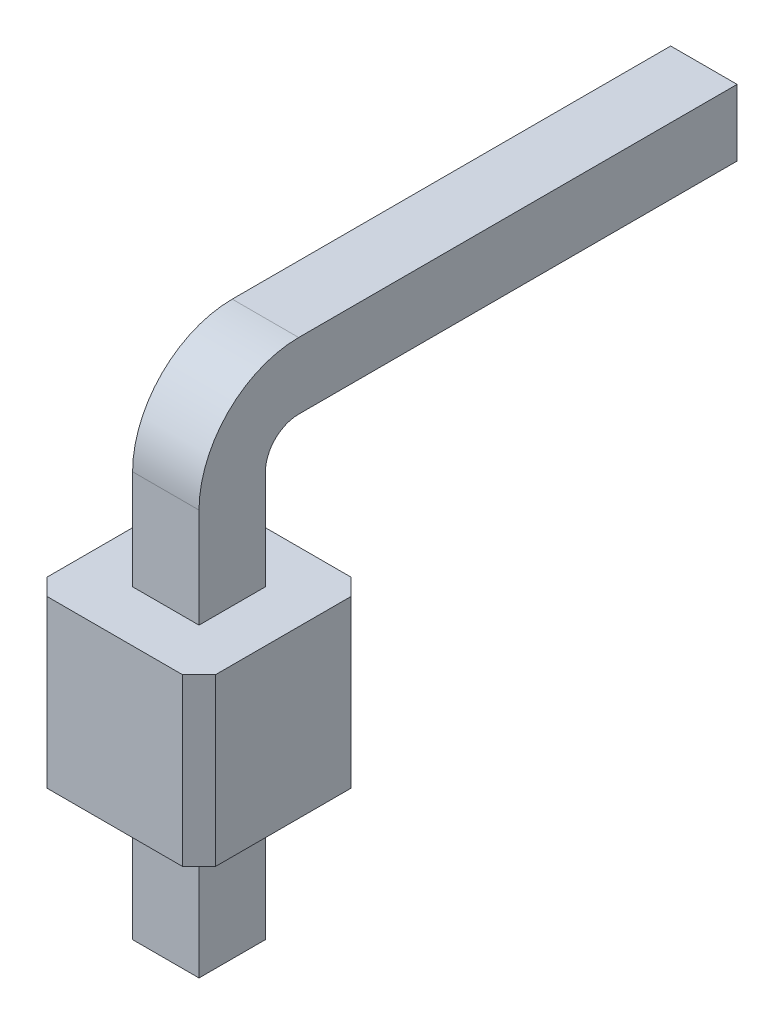
ISO-10303-21;
HEADER;
FILE_DESCRIPTION(('STEP AP214'),'2;1');
FILE_NAME('part.step','',(''),(''),'','','');
FILE_SCHEMA(('AUTOMOTIVE_DESIGN { 1 0 10303 214 1 1 1 1 }'));
ENDSEC;
DATA;
#1=APPLICATION_CONTEXT('core data for automotive mechanical design processes');
#2=APPLICATION_PROTOCOL_DEFINITION('international standard','automotive_design',2000,#1);
#3=PRODUCT_CONTEXT('',#1,'mechanical');
#4=PRODUCT('Part','Part','',(#3));
#5=PRODUCT_RELATED_PRODUCT_CATEGORY('part','',(#4));
#6=PRODUCT_DEFINITION_FORMATION('','',#4);
#7=PRODUCT_DEFINITION_CONTEXT('part definition',#1,'design');
#8=PRODUCT_DEFINITION('design','',#6,#7);
#9=PRODUCT_DEFINITION_SHAPE('','',#8);
#10=(LENGTH_UNIT() NAMED_UNIT(*) SI_UNIT(.MILLI.,.METRE.));
#11=(NAMED_UNIT(*) PLANE_ANGLE_UNIT() SI_UNIT($,.RADIAN.));
#12=(NAMED_UNIT(*) SI_UNIT($,.STERADIAN.) SOLID_ANGLE_UNIT());
#13=UNCERTAINTY_MEASURE_WITH_UNIT(LENGTH_MEASURE(1.E-05),#10,'distance_accuracy_value','');
#14=(GEOMETRIC_REPRESENTATION_CONTEXT(3) GLOBAL_UNCERTAINTY_ASSIGNED_CONTEXT((#13)) GLOBAL_UNIT_ASSIGNED_CONTEXT((#10,
#11,#12)) REPRESENTATION_CONTEXT('',''));
#15=CARTESIAN_POINT('',(0.,0.,0.));
#16=DIRECTION('',(0.,0.,1.));
#17=DIRECTION('',(1.,0.,0.));
#18=AXIS2_PLACEMENT_3D('',#15,#16,#17);
#19=CARTESIAN_POINT('',(0.,2.5,0.));
#20=DIRECTION('',(0.,-1.,0.));
#21=DIRECTION('',(0.,0.,-1.));
#22=AXIS2_PLACEMENT_3D('',#19,#20,#21);
#23=PLANE('',#22);
#24=DIRECTION('',(0.707106781186548,0.,-0.707106781186548));
#25=VECTOR('',#24,1.);
#26=CARTESIAN_POINT('',(1.02,2.5,1.27));
#27=LINE('',#26,#25);
#28=CARTESIAN_POINT('',(1.02,2.5,1.27));
#29=VERTEX_POINT('',#28);
#30=CARTESIAN_POINT('',(1.27,2.5,1.02));
#31=VERTEX_POINT('',#30);
#32=EDGE_CURVE('E261',#29,#31,#27,.T.);
#33=ORIENTED_EDGE('',*,*,#32,.T.);
#34=DIRECTION('',(0.,0.,-1.));
#35=VECTOR('',#34,1.);
#36=CARTESIAN_POINT('',(1.27,2.5,-1.02));
#37=LINE('',#36,#35);
#38=CARTESIAN_POINT('',(1.27,2.5,-1.02));
#39=VERTEX_POINT('',#38);
#40=EDGE_CURVE('E264',#31,#39,#37,.T.);
#41=ORIENTED_EDGE('',*,*,#40,.T.);
#42=DIRECTION('',(-0.707106781186548,0.,-0.707106781186547));
#43=VECTOR('',#42,1.);
#44=CARTESIAN_POINT('',(1.02,2.5,-1.27));
#45=LINE('',#44,#43);
#46=CARTESIAN_POINT('',(1.02,2.5,-1.27));
#47=VERTEX_POINT('',#46);
#48=EDGE_CURVE('E267',#39,#47,#45,.T.);
#49=ORIENTED_EDGE('',*,*,#48,.T.);
#50=DIRECTION('',(-1.,0.,0.));
#51=VECTOR('',#50,1.);
#52=CARTESIAN_POINT('',(-1.02,2.5,-1.27));
#53=LINE('',#52,#51);
#54=CARTESIAN_POINT('',(-1.02,2.5,-1.27));
#55=VERTEX_POINT('',#54);
#56=EDGE_CURVE('E269',#47,#55,#53,.T.);
#57=ORIENTED_EDGE('',*,*,#56,.T.);
#58=DIRECTION('',(-0.707106781186547,0.,0.707106781186548));
#59=VECTOR('',#58,1.);
#60=CARTESIAN_POINT('',(-1.27,2.5,-1.02));
#61=LINE('',#60,#59);
#62=CARTESIAN_POINT('',(-1.27,2.5,-1.02));
#63=VERTEX_POINT('',#62);
#64=EDGE_CURVE('E271',#55,#63,#61,.T.);
#65=ORIENTED_EDGE('',*,*,#64,.T.);
#66=DIRECTION('',(0.,0.,1.));
#67=VECTOR('',#66,1.);
#68=CARTESIAN_POINT('',(-1.27,2.5,1.02));
#69=LINE('',#68,#67);
#70=CARTESIAN_POINT('',(-1.27,2.5,1.02));
#71=VERTEX_POINT('',#70);
#72=EDGE_CURVE('E273',#63,#71,#69,.T.);
#73=ORIENTED_EDGE('',*,*,#72,.T.);
#74=DIRECTION('',(0.707106781186547,0.,0.707106781186548));
#75=VECTOR('',#74,1.);
#76=CARTESIAN_POINT('',(-1.02,2.5,1.27));
#77=LINE('',#76,#75);
#78=CARTESIAN_POINT('',(-1.02,2.5,1.27));
#79=VERTEX_POINT('',#78);
#80=EDGE_CURVE('E275',#71,#79,#77,.T.);
#81=ORIENTED_EDGE('',*,*,#80,.T.);
#82=DIRECTION('',(1.,0.,0.));
#83=VECTOR('',#82,1.);
#84=CARTESIAN_POINT('',(1.02,2.5,1.27));
#85=LINE('',#84,#83);
#86=EDGE_CURVE('E277',#79,#29,#85,.T.);
#87=ORIENTED_EDGE('',*,*,#86,.T.);
#88=EDGE_LOOP('',(#33,#41,#49,#57,#65,#73,#81,#87));
#89=FACE_BOUND('',#88,.T.);
#90=DIRECTION('',(0.,0.,1.));
#91=VECTOR('',#90,1.);
#92=CARTESIAN_POINT('',(-0.5,2.5,0.));
#93=LINE('',#92,#91);
#94=CARTESIAN_POINT('',(-0.5,2.5,-0.5));
#95=VERTEX_POINT('',#94);
#96=CARTESIAN_POINT('',(-0.5,2.5,0.5));
#97=VERTEX_POINT('',#96);
#98=EDGE_CURVE('E252',#95,#97,#93,.T.);
#99=ORIENTED_EDGE('',*,*,#98,.F.);
#100=DIRECTION('',(1.,0.,0.));
#101=VECTOR('',#100,1.);
#102=CARTESIAN_POINT('',(0.,2.5,-0.5));
#103=LINE('',#102,#101);
#104=CARTESIAN_POINT('',(0.5,2.5,-0.5));
#105=VERTEX_POINT('',#104);
#106=EDGE_CURVE('E257',#95,#105,#103,.T.);
#107=ORIENTED_EDGE('',*,*,#106,.T.);
#108=DIRECTION('',(0.,0.,1.));
#109=VECTOR('',#108,1.);
#110=CARTESIAN_POINT('',(0.5,2.5,0.));
#111=LINE('',#110,#109);
#112=CARTESIAN_POINT('',(0.5,2.5,0.5));
#113=VERTEX_POINT('',#112);
#114=EDGE_CURVE('E245',#105,#113,#111,.T.);
#115=ORIENTED_EDGE('',*,*,#114,.T.);
#116=DIRECTION('',(1.,0.,0.));
#117=VECTOR('',#116,1.);
#118=CARTESIAN_POINT('',(0.,2.5,0.5));
#119=LINE('',#118,#117);
#120=EDGE_CURVE('E254',#97,#113,#119,.T.);
#121=ORIENTED_EDGE('',*,*,#120,.F.);
#122=EDGE_LOOP('',(#99,#107,#115,#121));
#123=FACE_BOUND('',#122,.T.);
#124=ADVANCED_FACE('F34',(#89,#123),#23,.F.);
#125=CARTESIAN_POINT('',(0.,0.,0.));
#126=DIRECTION('',(0.,-1.,0.));
#127=DIRECTION('',(0.,0.,-1.));
#128=AXIS2_PLACEMENT_3D('',#125,#126,#127);
#129=PLANE('',#128);
#130=DIRECTION('',(0.707106781186548,0.,-0.707106781186548));
#131=VECTOR('',#130,1.);
#132=CARTESIAN_POINT('',(1.02,0.,1.27));
#133=LINE('',#132,#131);
#134=CARTESIAN_POINT('',(1.02,0.,1.27));
#135=VERTEX_POINT('',#134);
#136=CARTESIAN_POINT('',(1.27,0.,1.02));
#137=VERTEX_POINT('',#136);
#138=EDGE_CURVE('E260',#135,#137,#133,.T.);
#139=ORIENTED_EDGE('',*,*,#138,.F.);
#140=DIRECTION('',(1.,0.,0.));
#141=VECTOR('',#140,1.);
#142=CARTESIAN_POINT('',(1.02,0.,1.27));
#143=LINE('',#142,#141);
#144=CARTESIAN_POINT('',(-1.02,0.,1.27));
#145=VERTEX_POINT('',#144);
#146=EDGE_CURVE('E265',#145,#135,#143,.T.);
#147=ORIENTED_EDGE('',*,*,#146,.F.);
#148=DIRECTION('',(0.707106781186547,0.,0.707106781186548));
#149=VECTOR('',#148,1.);
#150=CARTESIAN_POINT('',(-1.02,0.,1.27));
#151=LINE('',#150,#149);
#152=CARTESIAN_POINT('',(-1.27,0.,1.02));
#153=VERTEX_POINT('',#152);
#154=EDGE_CURVE('E292',#153,#145,#151,.T.);
#155=ORIENTED_EDGE('',*,*,#154,.F.);
#156=DIRECTION('',(0.,0.,1.));
#157=VECTOR('',#156,1.);
#158=CARTESIAN_POINT('',(-1.27,0.,1.02));
#159=LINE('',#158,#157);
#160=CARTESIAN_POINT('',(-1.27,0.,-1.02));
#161=VERTEX_POINT('',#160);
#162=EDGE_CURVE('E290',#161,#153,#159,.T.);
#163=ORIENTED_EDGE('',*,*,#162,.F.);
#164=DIRECTION('',(-0.707106781186547,0.,0.707106781186548));
#165=VECTOR('',#164,1.);
#166=CARTESIAN_POINT('',(-1.27,0.,-1.02));
#167=LINE('',#166,#165);
#168=CARTESIAN_POINT('',(-1.02,0.,-1.27));
#169=VERTEX_POINT('',#168);
#170=EDGE_CURVE('E288',#169,#161,#167,.T.);
#171=ORIENTED_EDGE('',*,*,#170,.F.);
#172=DIRECTION('',(-1.,0.,0.));
#173=VECTOR('',#172,1.);
#174=CARTESIAN_POINT('',(-1.02,0.,-1.27));
#175=LINE('',#174,#173);
#176=CARTESIAN_POINT('',(1.02,0.,-1.27));
#177=VERTEX_POINT('',#176);
#178=EDGE_CURVE('E286',#177,#169,#175,.T.);
#179=ORIENTED_EDGE('',*,*,#178,.F.);
#180=DIRECTION('',(-0.707106781186548,0.,-0.707106781186547));
#181=VECTOR('',#180,1.);
#182=CARTESIAN_POINT('',(1.02,0.,-1.27));
#183=LINE('',#182,#181);
#184=CARTESIAN_POINT('',(1.27,0.,-1.02));
#185=VERTEX_POINT('',#184);
#186=EDGE_CURVE('E284',#185,#177,#183,.T.);
#187=ORIENTED_EDGE('',*,*,#186,.F.);
#188=DIRECTION('',(0.,0.,-1.));
#189=VECTOR('',#188,1.);
#190=CARTESIAN_POINT('',(1.27,0.,-1.02));
#191=LINE('',#190,#189);
#192=EDGE_CURVE('E282',#137,#185,#191,.T.);
#193=ORIENTED_EDGE('',*,*,#192,.F.);
#194=EDGE_LOOP('',(#139,#147,#155,#163,#171,#179,#187,#193));
#195=FACE_BOUND('',#194,.T.);
#196=DIRECTION('',(1.,0.,0.));
#197=VECTOR('',#196,1.);
#198=CARTESIAN_POINT('',(0.,0.,-0.5));
#199=LINE('',#198,#197);
#200=CARTESIAN_POINT('',(-0.5,0.,-0.5));
#201=VERTEX_POINT('',#200);
#202=CARTESIAN_POINT('',(0.5,0.,-0.5));
#203=VERTEX_POINT('',#202);
#204=EDGE_CURVE('E324',#201,#203,#199,.T.);
#205=ORIENTED_EDGE('',*,*,#204,.F.);
#206=DIRECTION('',(0.,0.,1.));
#207=VECTOR('',#206,1.);
#208=CARTESIAN_POINT('',(-0.5,0.,0.));
#209=LINE('',#208,#207);
#210=CARTESIAN_POINT('',(-0.5,0.,0.5));
#211=VERTEX_POINT('',#210);
#212=EDGE_CURVE('E327',#201,#211,#209,.T.);
#213=ORIENTED_EDGE('',*,*,#212,.T.);
#214=DIRECTION('',(1.,0.,0.));
#215=VECTOR('',#214,1.);
#216=CARTESIAN_POINT('',(0.,0.,0.5));
#217=LINE('',#216,#215);
#218=CARTESIAN_POINT('',(0.5,0.,0.5));
#219=VERTEX_POINT('',#218);
#220=EDGE_CURVE('E321',#211,#219,#217,.T.);
#221=ORIENTED_EDGE('',*,*,#220,.T.);
#222=DIRECTION('',(0.,0.,1.));
#223=VECTOR('',#222,1.);
#224=CARTESIAN_POINT('',(0.5,0.,0.));
#225=LINE('',#224,#223);
#226=EDGE_CURVE('E318',#203,#219,#225,.T.);
#227=ORIENTED_EDGE('',*,*,#226,.F.);
#228=EDGE_LOOP('',(#205,#213,#221,#227));
#229=FACE_BOUND('',#228,.T.);
#230=ADVANCED_FACE('F431',(#195,#229),#129,.T.);
#231=CARTESIAN_POINT('',(1.02,2.5,1.27));
#232=DIRECTION('',(-0.707106781186548,0.,-0.707106781186548));
#233=DIRECTION('',(-0.707106781186548,0.,0.707106781186548));
#234=AXIS2_PLACEMENT_3D('',#231,#232,#233);
#235=PLANE('',#234);
#236=ORIENTED_EDGE('',*,*,#138,.T.);
#237=DIRECTION('',(0.,-1.,0.));
#238=VECTOR('',#237,1.);
#239=CARTESIAN_POINT('',(1.27,2.5,1.02));
#240=LINE('',#239,#238);
#241=EDGE_CURVE('E315',#31,#137,#240,.T.);
#242=ORIENTED_EDGE('',*,*,#241,.F.);
#243=ORIENTED_EDGE('',*,*,#32,.F.);
#244=DIRECTION('',(0.,-1.,0.));
#245=VECTOR('',#244,1.);
#246=CARTESIAN_POINT('',(1.02,2.5,1.27));
#247=LINE('',#246,#245);
#248=EDGE_CURVE('E279',#29,#135,#247,.T.);
#249=ORIENTED_EDGE('',*,*,#248,.T.);
#250=EDGE_LOOP('',(#236,#242,#243,#249));
#251=FACE_BOUND('',#250,.T.);
#252=ADVANCED_FACE('F437',(#251),#235,.F.);
#253=CARTESIAN_POINT('',(1.27,2.5,-1.02));
#254=DIRECTION('',(-1.,0.,0.));
#255=DIRECTION('',(0.,0.,1.));
#256=AXIS2_PLACEMENT_3D('',#253,#254,#255);
#257=PLANE('',#256);
#258=ORIENTED_EDGE('',*,*,#192,.T.);
#259=DIRECTION('',(0.,-1.,0.));
#260=VECTOR('',#259,1.);
#261=CARTESIAN_POINT('',(1.27,2.5,-1.02));
#262=LINE('',#261,#260);
#263=EDGE_CURVE('E312',#39,#185,#262,.T.);
#264=ORIENTED_EDGE('',*,*,#263,.F.);
#265=ORIENTED_EDGE('',*,*,#40,.F.);
#266=ORIENTED_EDGE('',*,*,#241,.T.);
#267=EDGE_LOOP('',(#258,#264,#265,#266));
#268=FACE_BOUND('',#267,.T.);
#269=ADVANCED_FACE('F467',(#268),#257,.F.);
#270=CARTESIAN_POINT('',(1.02,2.5,-1.27));
#271=DIRECTION('',(-0.707106781186547,0.,0.707106781186548));
#272=DIRECTION('',(0.707106781186548,0.,0.707106781186547));
#273=AXIS2_PLACEMENT_3D('',#270,#271,#272);
#274=PLANE('',#273);
#275=ORIENTED_EDGE('',*,*,#186,.T.);
#276=DIRECTION('',(0.,-1.,0.));
#277=VECTOR('',#276,1.);
#278=CARTESIAN_POINT('',(1.02,2.5,-1.27));
#279=LINE('',#278,#277);
#280=EDGE_CURVE('E309',#47,#177,#279,.T.);
#281=ORIENTED_EDGE('',*,*,#280,.F.);
#282=ORIENTED_EDGE('',*,*,#48,.F.);
#283=ORIENTED_EDGE('',*,*,#263,.T.);
#284=EDGE_LOOP('',(#275,#281,#282,#283));
#285=FACE_BOUND('',#284,.T.);
#286=ADVANCED_FACE('F463',(#285),#274,.F.);
#287=CARTESIAN_POINT('',(-1.02,2.5,-1.27));
#288=DIRECTION('',(0.,0.,1.));
#289=DIRECTION('',(1.,0.,0.));
#290=AXIS2_PLACEMENT_3D('',#287,#288,#289);
#291=PLANE('',#290);
#292=ORIENTED_EDGE('',*,*,#178,.T.);
#293=DIRECTION('',(0.,-1.,0.));
#294=VECTOR('',#293,1.);
#295=CARTESIAN_POINT('',(-1.02,2.5,-1.27));
#296=LINE('',#295,#294);
#297=EDGE_CURVE('E306',#55,#169,#296,.T.);
#298=ORIENTED_EDGE('',*,*,#297,.F.);
#299=ORIENTED_EDGE('',*,*,#56,.F.);
#300=ORIENTED_EDGE('',*,*,#280,.T.);
#301=EDGE_LOOP('',(#292,#298,#299,#300));
#302=FACE_BOUND('',#301,.T.);
#303=ADVANCED_FACE('F459',(#302),#291,.F.);
#304=CARTESIAN_POINT('',(-1.27,2.5,-1.02));
#305=DIRECTION('',(0.707106781186548,0.,0.707106781186547));
#306=DIRECTION('',(0.707106781186547,0.,-0.707106781186548));
#307=AXIS2_PLACEMENT_3D('',#304,#305,#306);
#308=PLANE('',#307);
#309=ORIENTED_EDGE('',*,*,#170,.T.);
#310=DIRECTION('',(0.,-1.,0.));
#311=VECTOR('',#310,1.);
#312=CARTESIAN_POINT('',(-1.27,2.5,-1.02));
#313=LINE('',#312,#311);
#314=EDGE_CURVE('E303',#63,#161,#313,.T.);
#315=ORIENTED_EDGE('',*,*,#314,.F.);
#316=ORIENTED_EDGE('',*,*,#64,.F.);
#317=ORIENTED_EDGE('',*,*,#297,.T.);
#318=EDGE_LOOP('',(#309,#315,#316,#317));
#319=FACE_BOUND('',#318,.T.);
#320=ADVANCED_FACE('F455',(#319),#308,.F.);
#321=CARTESIAN_POINT('',(-1.27,2.5,1.02));
#322=DIRECTION('',(1.,0.,0.));
#323=DIRECTION('',(0.,0.,-1.));
#324=AXIS2_PLACEMENT_3D('',#321,#322,#323);
#325=PLANE('',#324);
#326=ORIENTED_EDGE('',*,*,#162,.T.);
#327=DIRECTION('',(0.,-1.,0.));
#328=VECTOR('',#327,1.);
#329=CARTESIAN_POINT('',(-1.27,2.5,1.02));
#330=LINE('',#329,#328);
#331=EDGE_CURVE('E300',#71,#153,#330,.T.);
#332=ORIENTED_EDGE('',*,*,#331,.F.);
#333=ORIENTED_EDGE('',*,*,#72,.F.);
#334=ORIENTED_EDGE('',*,*,#314,.T.);
#335=EDGE_LOOP('',(#326,#332,#333,#334));
#336=FACE_BOUND('',#335,.T.);
#337=ADVANCED_FACE('F451',(#336),#325,.F.);
#338=CARTESIAN_POINT('',(-1.02,2.5,1.27));
#339=DIRECTION('',(0.707106781186548,0.,-0.707106781186547));
#340=DIRECTION('',(-0.707106781186547,0.,-0.707106781186548));
#341=AXIS2_PLACEMENT_3D('',#338,#339,#340);
#342=PLANE('',#341);
#343=ORIENTED_EDGE('',*,*,#154,.T.);
#344=DIRECTION('',(0.,-1.,0.));
#345=VECTOR('',#344,1.);
#346=CARTESIAN_POINT('',(-1.02,2.5,1.27));
#347=LINE('',#346,#345);
#348=EDGE_CURVE('E297',#79,#145,#347,.T.);
#349=ORIENTED_EDGE('',*,*,#348,.F.);
#350=ORIENTED_EDGE('',*,*,#80,.F.);
#351=ORIENTED_EDGE('',*,*,#331,.T.);
#352=EDGE_LOOP('',(#343,#349,#350,#351));
#353=FACE_BOUND('',#352,.T.);
#354=ADVANCED_FACE('F447',(#353),#342,.F.);
#355=CARTESIAN_POINT('',(1.02,2.5,1.27));
#356=DIRECTION('',(0.,0.,-1.));
#357=DIRECTION('',(-1.,0.,0.));
#358=AXIS2_PLACEMENT_3D('',#355,#356,#357);
#359=PLANE('',#358);
#360=ORIENTED_EDGE('',*,*,#146,.T.);
#361=ORIENTED_EDGE('',*,*,#248,.F.);
#362=ORIENTED_EDGE('',*,*,#86,.F.);
#363=ORIENTED_EDGE('',*,*,#348,.T.);
#364=EDGE_LOOP('',(#360,#361,#362,#363));
#365=FACE_BOUND('',#364,.T.);
#366=ADVANCED_FACE('F443',(#365),#359,.F.);
#367=CARTESIAN_POINT('',(-0.5,-2.5,-0.5));
#368=DIRECTION('',(0.,1.,0.));
#369=DIRECTION('',(0.,0.,1.));
#370=AXIS2_PLACEMENT_3D('',#367,#368,#369);
#371=PLANE('',#370);
#372=DIRECTION('',(0.,0.,-1.));
#373=VECTOR('',#372,1.);
#374=CARTESIAN_POINT('',(-0.0999999999999972,-2.5,-0.5));
#375=LINE('',#374,#373);
#376=CARTESIAN_POINT('',(-0.0999999999999972,-2.5,0.099999999999997));
#377=VERTEX_POINT('',#376);
#378=CARTESIAN_POINT('',(-0.0999999999999972,-2.5,-0.0999999999999972));
#379=VERTEX_POINT('',#378);
#380=EDGE_CURVE('E334',#377,#379,#375,.T.);
#381=ORIENTED_EDGE('',*,*,#380,.T.);
#382=DIRECTION('',(1.,0.,0.));
#383=VECTOR('',#382,1.);
#384=CARTESIAN_POINT('',(0.5,-2.5,-0.0999999999999972));
#385=LINE('',#384,#383);
#386=CARTESIAN_POINT('',(0.0999999999999972,-2.5,-0.0999999999999972));
#387=VERTEX_POINT('',#386);
#388=EDGE_CURVE('E336',#379,#387,#385,.T.);
#389=ORIENTED_EDGE('',*,*,#388,.T.);
#390=DIRECTION('',(0.,0.,1.));
#391=VECTOR('',#390,1.);
#392=CARTESIAN_POINT('',(0.0999999999999972,-2.5,0.5));
#393=LINE('',#392,#391);
#394=CARTESIAN_POINT('',(0.0999999999999972,-2.5,0.099999999999997));
#395=VERTEX_POINT('',#394);
#396=EDGE_CURVE('E330',#387,#395,#393,.T.);
#397=ORIENTED_EDGE('',*,*,#396,.T.);
#398=DIRECTION('',(-1.,0.,0.));
#399=VECTOR('',#398,1.);
#400=CARTESIAN_POINT('',(-0.5,-2.5,0.099999999999997));
#401=LINE('',#400,#399);
#402=EDGE_CURVE('E332',#395,#377,#401,.T.);
#403=ORIENTED_EDGE('',*,*,#402,.T.);
#404=EDGE_LOOP('',(#381,#389,#397,#403));
#405=FACE_BOUND('',#404,.T.);
#406=ADVANCED_FACE('F446',(#405),#371,.F.);
#407=CARTESIAN_POINT('',(0.5,4.,-1.));
#408=DIRECTION('',(1.,0.,0.));
#409=DIRECTION('',(0.,0.,-1.));
#410=AXIS2_PLACEMENT_3D('',#407,#408,#409);
#411=PLANE('',#410);
#412=DIRECTION('',(0.,1.,0.));
#413=VECTOR('',#412,1.);
#414=CARTESIAN_POINT('',(0.5,0.,0.5));
#415=LINE('',#414,#413);
#416=CARTESIAN_POINT('',(0.5,-2.1,0.5));
#417=VERTEX_POINT('',#416);
#418=EDGE_CURVE('E220',#417,#219,#415,.T.);
#419=ORIENTED_EDGE('',*,*,#418,.F.);
#420=DIRECTION('',(0.,0.,-1.));
#421=VECTOR('',#420,1.);
#422=CARTESIAN_POINT('',(0.5,-2.1,-0.5));
#423=LINE('',#422,#421);
#424=CARTESIAN_POINT('',(0.5,-2.1,-0.5));
#425=VERTEX_POINT('',#424);
#426=EDGE_CURVE('E346',#417,#425,#423,.T.);
#427=ORIENTED_EDGE('',*,*,#426,.T.);
#428=DIRECTION('',(0.,1.,0.));
#429=VECTOR('',#428,1.);
#430=CARTESIAN_POINT('',(0.5,0.,-0.5));
#431=LINE('',#430,#429);
#432=EDGE_CURVE('E225',#425,#203,#431,.T.);
#433=ORIENTED_EDGE('',*,*,#432,.T.);
#434=ORIENTED_EDGE('',*,*,#226,.T.);
#435=EDGE_LOOP('',(#419,#427,#433,#434));
#436=FACE_BOUND('',#435,.T.);
#437=ADVANCED_FACE('F550',(#436),#411,.T.);
#438=CARTESIAN_POINT('',(-0.5,4.,-1.));
#439=DIRECTION('',(1.,0.,0.));
#440=DIRECTION('',(0.,0.,-1.));
#441=AXIS2_PLACEMENT_3D('',#438,#439,#440);
#442=PLANE('',#441);
#443=DIRECTION('',(0.,1.,0.));
#444=VECTOR('',#443,1.);
#445=CARTESIAN_POINT('',(-0.5,0.,-0.5));
#446=LINE('',#445,#444);
#447=CARTESIAN_POINT('',(-0.5,-2.1,-0.5));
#448=VERTEX_POINT('',#447);
#449=EDGE_CURVE('E239',#448,#201,#446,.T.);
#450=ORIENTED_EDGE('',*,*,#449,.F.);
#451=DIRECTION('',(0.,0.,1.));
#452=VECTOR('',#451,1.);
#453=CARTESIAN_POINT('',(-0.5,-2.1,-1.));
#454=LINE('',#453,#452);
#455=CARTESIAN_POINT('',(-0.5,-2.1,0.5));
#456=VERTEX_POINT('',#455);
#457=EDGE_CURVE('E342',#448,#456,#454,.T.);
#458=ORIENTED_EDGE('',*,*,#457,.T.);
#459=DIRECTION('',(0.,1.,0.));
#460=VECTOR('',#459,1.);
#461=CARTESIAN_POINT('',(-0.5,0.,0.5));
#462=LINE('',#461,#460);
#463=EDGE_CURVE('E236',#456,#211,#462,.T.);
#464=ORIENTED_EDGE('',*,*,#463,.T.);
#465=ORIENTED_EDGE('',*,*,#212,.F.);
#466=EDGE_LOOP('',(#450,#458,#464,#465));
#467=FACE_BOUND('',#466,.T.);
#468=ADVANCED_FACE('F423',(#467),#442,.F.);
#469=CARTESIAN_POINT('',(-0.5,0.,0.5));
#470=DIRECTION('',(0.,0.,-1.));
#471=DIRECTION('',(0.,1.,0.));
#472=AXIS2_PLACEMENT_3D('',#469,#470,#471);
#473=PLANE('',#472);
#474=ORIENTED_EDGE('',*,*,#463,.F.);
#475=DIRECTION('',(1.,0.,0.));
#476=VECTOR('',#475,1.);
#477=CARTESIAN_POINT('',(-0.5,-2.1,0.5));
#478=LINE('',#477,#476);
#479=EDGE_CURVE('E344',#456,#417,#478,.T.);
#480=ORIENTED_EDGE('',*,*,#479,.T.);
#481=ORIENTED_EDGE('',*,*,#418,.T.);
#482=ORIENTED_EDGE('',*,*,#220,.F.);
#483=EDGE_LOOP('',(#474,#480,#481,#482));
#484=FACE_BOUND('',#483,.T.);
#485=ADVANCED_FACE('F417',(#484),#473,.F.);
#486=CARTESIAN_POINT('',(-0.5,0.,-0.5));
#487=DIRECTION('',(0.,0.,-1.));
#488=DIRECTION('',(-1.,0.,0.));
#489=AXIS2_PLACEMENT_3D('',#486,#487,#488);
#490=PLANE('',#489);
#491=ORIENTED_EDGE('',*,*,#432,.F.);
#492=DIRECTION('',(-1.,0.,0.));
#493=VECTOR('',#492,1.);
#494=CARTESIAN_POINT('',(-0.5,-2.1,-0.5));
#495=LINE('',#494,#493);
#496=EDGE_CURVE('E339',#425,#448,#495,.T.);
#497=ORIENTED_EDGE('',*,*,#496,.T.);
#498=ORIENTED_EDGE('',*,*,#449,.T.);
#499=ORIENTED_EDGE('',*,*,#204,.T.);
#500=EDGE_LOOP('',(#491,#497,#498,#499));
#501=FACE_BOUND('',#500,.T.);
#502=ADVANCED_FACE('F424',(#501),#490,.T.);
#503=ORIENTED_EDGE('',*,*,#106,.F.);
#504=CARTESIAN_POINT('',(-0.5,4.,-0.5));
#505=VERTEX_POINT('',#504);
#506=EDGE_CURVE('E238',#95,#505,#446,.T.);
#507=ORIENTED_EDGE('',*,*,#506,.T.);
#508=DIRECTION('',(1.,0.,0.));
#509=VECTOR('',#508,1.);
#510=CARTESIAN_POINT('',(-0.5,4.,-0.5));
#511=LINE('',#510,#509);
#512=CARTESIAN_POINT('',(0.5,4.,-0.5));
#513=VERTEX_POINT('',#512);
#514=EDGE_CURVE('E246',#505,#513,#511,.T.);
#515=ORIENTED_EDGE('',*,*,#514,.T.);
#516=EDGE_CURVE('E224',#105,#513,#431,.T.);
#517=ORIENTED_EDGE('',*,*,#516,.F.);
#518=EDGE_LOOP('',(#503,#507,#515,#517));
#519=FACE_BOUND('',#518,.T.);
#520=ADVANCED_FACE('F407',(#519),#490,.T.);
#521=CARTESIAN_POINT('',(-0.5,4.,0.5));
#522=VERTEX_POINT('',#521);
#523=EDGE_CURVE('E235',#97,#522,#462,.T.);
#524=ORIENTED_EDGE('',*,*,#523,.F.);
#525=ORIENTED_EDGE('',*,*,#120,.T.);
#526=CARTESIAN_POINT('',(0.5,4.,0.5));
#527=VERTEX_POINT('',#526);
#528=EDGE_CURVE('E218',#113,#527,#415,.T.);
#529=ORIENTED_EDGE('',*,*,#528,.T.);
#530=DIRECTION('',(1.,0.,0.));
#531=VECTOR('',#530,1.);
#532=CARTESIAN_POINT('',(-0.5,4.,0.5));
#533=LINE('',#532,#531);
#534=EDGE_CURVE('E207',#522,#527,#533,.T.);
#535=ORIENTED_EDGE('',*,*,#534,.F.);
#536=EDGE_LOOP('',(#524,#525,#529,#535));
#537=FACE_BOUND('',#536,.T.);
#538=ADVANCED_FACE('F414',(#537),#473,.F.);
#539=DIRECTION('',(0.,0.,-1.));
#540=VECTOR('',#539,1.);
#541=CARTESIAN_POINT('',(-0.5,5.5,-1.));
#542=LINE('',#541,#540);
#543=CARTESIAN_POINT('',(-0.5,5.5,-1.));
#544=VERTEX_POINT('',#543);
#545=CARTESIAN_POINT('',(-0.5,5.5,-7.6));
#546=VERTEX_POINT('',#545);
#547=EDGE_CURVE('E203',#544,#546,#542,.T.);
#548=ORIENTED_EDGE('',*,*,#547,.T.);
#549=DIRECTION('',(0.,-1.,0.));
#550=VECTOR('',#549,1.);
#551=CARTESIAN_POINT('',(-0.5,4.,-7.6));
#552=LINE('',#551,#550);
#553=CARTESIAN_POINT('',(-0.5,4.5,-7.6));
#554=VERTEX_POINT('',#553);
#555=EDGE_CURVE('E348',#546,#554,#552,.T.);
#556=ORIENTED_EDGE('',*,*,#555,.T.);
#557=DIRECTION('',(0.,0.,-1.));
#558=VECTOR('',#557,1.);
#559=CARTESIAN_POINT('',(-0.5,4.5,-1.));
#560=LINE('',#559,#558);
#561=CARTESIAN_POINT('',(-0.5,4.5,-1.));
#562=VERTEX_POINT('',#561);
#563=EDGE_CURVE('E230',#562,#554,#560,.T.);
#564=ORIENTED_EDGE('',*,*,#563,.F.);
#565=CARTESIAN_POINT('',(-0.5,4.,-1.));
#566=DIRECTION('',(1.,0.,0.));
#567=DIRECTION('',(0.,0.,-1.));
#568=AXIS2_PLACEMENT_3D('',#565,#566,#567);
#569=CIRCLE('',#568,0.5);
#570=EDGE_CURVE('E208',#505,#562,#569,.F.);
#571=ORIENTED_EDGE('',*,*,#570,.F.);
#572=ORIENTED_EDGE('',*,*,#506,.F.);
#573=ORIENTED_EDGE('',*,*,#98,.T.);
#574=ORIENTED_EDGE('',*,*,#523,.T.);
#575=CARTESIAN_POINT('',(-0.5,4.,-1.));
#576=DIRECTION('',(1.,0.,0.));
#577=DIRECTION('',(0.,0.,-1.));
#578=AXIS2_PLACEMENT_3D('',#575,#576,#577);
#579=CIRCLE('',#578,1.5);
#580=EDGE_CURVE('E233',#522,#544,#579,.F.);
#581=ORIENTED_EDGE('',*,*,#580,.T.);
#582=EDGE_LOOP('',(#548,#556,#564,#571,#572,#573,#574,#581));
#583=FACE_BOUND('',#582,.T.);
#584=ADVANCED_FACE('F398',(#583),#442,.F.);
#585=DIRECTION('',(0.,0.,-1.));
#586=VECTOR('',#585,1.);
#587=CARTESIAN_POINT('',(0.5,4.5,-1.));
#588=LINE('',#587,#586);
#589=CARTESIAN_POINT('',(0.5,4.5,-1.));
#590=VERTEX_POINT('',#589);
#591=CARTESIAN_POINT('',(0.5,4.5,-7.6));
#592=VERTEX_POINT('',#591);
#593=EDGE_CURVE('E213',#590,#592,#588,.T.);
#594=ORIENTED_EDGE('',*,*,#593,.T.);
#595=DIRECTION('',(0.,1.,0.));
#596=VECTOR('',#595,1.);
#597=CARTESIAN_POINT('',(0.5,5.5,-7.6));
#598=LINE('',#597,#596);
#599=CARTESIAN_POINT('',(0.5,5.5,-7.6));
#600=VERTEX_POINT('',#599);
#601=EDGE_CURVE('E43',#592,#600,#598,.T.);
#602=ORIENTED_EDGE('',*,*,#601,.T.);
#603=DIRECTION('',(0.,0.,-1.));
#604=VECTOR('',#603,1.);
#605=CARTESIAN_POINT('',(0.5,5.5,-1.));
#606=LINE('',#605,#604);
#607=CARTESIAN_POINT('',(0.5,5.5,-1.));
#608=VERTEX_POINT('',#607);
#609=EDGE_CURVE('E200',#608,#600,#606,.T.);
#610=ORIENTED_EDGE('',*,*,#609,.F.);
#611=CARTESIAN_POINT('',(0.5,4.,-1.));
#612=DIRECTION('',(1.,0.,0.));
#613=DIRECTION('',(0.,0.,-1.));
#614=AXIS2_PLACEMENT_3D('',#611,#612,#613);
#615=CIRCLE('',#614,1.5);
#616=EDGE_CURVE('E212',#527,#608,#615,.F.);
#617=ORIENTED_EDGE('',*,*,#616,.F.);
#618=ORIENTED_EDGE('',*,*,#528,.F.);
#619=ORIENTED_EDGE('',*,*,#114,.F.);
#620=ORIENTED_EDGE('',*,*,#516,.T.);
#621=CARTESIAN_POINT('',(0.5,4.,-1.));
#622=DIRECTION('',(1.,0.,0.));
#623=DIRECTION('',(0.,0.,-1.));
#624=AXIS2_PLACEMENT_3D('',#621,#622,#623);
#625=CIRCLE('',#624,0.5);
#626=EDGE_CURVE('E227',#513,#590,#625,.F.);
#627=ORIENTED_EDGE('',*,*,#626,.T.);
#628=EDGE_LOOP('',(#594,#602,#610,#617,#618,#619,#620,#627));
#629=FACE_BOUND('',#628,.T.);
#630=ADVANCED_FACE('F211',(#629),#411,.T.);
#631=CARTESIAN_POINT('',(-0.5,4.5,-1.));
#632=DIRECTION('',(0.,-1.,0.));
#633=DIRECTION('',(0.,0.,-1.));
#634=AXIS2_PLACEMENT_3D('',#631,#632,#633);
#635=PLANE('',#634);
#636=ORIENTED_EDGE('',*,*,#563,.T.);
#637=DIRECTION('',(1.,0.,0.));
#638=VECTOR('',#637,1.);
#639=CARTESIAN_POINT('',(0.5,4.5,-7.6));
#640=LINE('',#639,#638);
#641=EDGE_CURVE('E58',#554,#592,#640,.T.);
#642=ORIENTED_EDGE('',*,*,#641,.T.);
#643=ORIENTED_EDGE('',*,*,#593,.F.);
#644=DIRECTION('',(1.,0.,0.));
#645=VECTOR('',#644,1.);
#646=CARTESIAN_POINT('',(-0.5,4.5,-1.));
#647=LINE('',#646,#645);
#648=EDGE_CURVE('E243',#562,#590,#647,.T.);
#649=ORIENTED_EDGE('',*,*,#648,.F.);
#650=EDGE_LOOP('',(#636,#642,#643,#649));
#651=FACE_BOUND('',#650,.T.);
#652=ADVANCED_FACE('F400',(#651),#635,.T.);
#653=CARTESIAN_POINT('',(-0.5,4.,-1.));
#654=DIRECTION('',(1.,0.,0.));
#655=DIRECTION('',(0.,0.,-1.));
#656=AXIS2_PLACEMENT_3D('',#653,#654,#655);
#657=CYLINDRICAL_SURFACE('',#656,0.5);
#658=ORIENTED_EDGE('',*,*,#648,.T.);
#659=ORIENTED_EDGE('',*,*,#626,.F.);
#660=ORIENTED_EDGE('',*,*,#514,.F.);
#661=ORIENTED_EDGE('',*,*,#570,.T.);
#662=EDGE_LOOP('',(#658,#659,#660,#661));
#663=FACE_BOUND('',#662,.T.);
#664=ADVANCED_FACE('F403',(#663),#657,.F.);
#665=CARTESIAN_POINT('',(-0.5,4.,-1.));
#666=DIRECTION('',(1.,0.,0.));
#667=DIRECTION('',(0.,0.,-1.));
#668=AXIS2_PLACEMENT_3D('',#665,#666,#667);
#669=CYLINDRICAL_SURFACE('',#668,1.5);
#670=ORIENTED_EDGE('',*,*,#534,.T.);
#671=ORIENTED_EDGE('',*,*,#616,.T.);
#672=DIRECTION('',(1.,0.,0.));
#673=VECTOR('',#672,1.);
#674=CARTESIAN_POINT('',(-0.5,5.5,-1.));
#675=LINE('',#674,#673);
#676=EDGE_CURVE('E198',#544,#608,#675,.T.);
#677=ORIENTED_EDGE('',*,*,#676,.F.);
#678=ORIENTED_EDGE('',*,*,#580,.F.);
#679=EDGE_LOOP('',(#670,#671,#677,#678));
#680=FACE_BOUND('',#679,.T.);
#681=ADVANCED_FACE('F216',(#680),#669,.T.);
#682=CARTESIAN_POINT('',(-0.5,5.5,-1.));
#683=DIRECTION('',(0.,-1.,0.));
#684=DIRECTION('',(0.,0.,-1.));
#685=AXIS2_PLACEMENT_3D('',#682,#683,#684);
#686=PLANE('',#685);
#687=ORIENTED_EDGE('',*,*,#609,.T.);
#688=DIRECTION('',(-1.,0.,0.));
#689=VECTOR('',#688,1.);
#690=CARTESIAN_POINT('',(-0.5,5.5,-7.6));
#691=LINE('',#690,#689);
#692=EDGE_CURVE('E11',#600,#546,#691,.T.);
#693=ORIENTED_EDGE('',*,*,#692,.T.);
#694=ORIENTED_EDGE('',*,*,#547,.F.);
#695=ORIENTED_EDGE('',*,*,#676,.T.);
#696=EDGE_LOOP('',(#687,#693,#694,#695));
#697=FACE_BOUND('',#696,.T.);
#698=ADVANCED_FACE('F199',(#697),#686,.F.);
#699=CARTESIAN_POINT('',(-0.5,5.5,-8.));
#700=DIRECTION('',(0.,0.,1.));
#701=DIRECTION('',(1.,0.,0.));
#702=AXIS2_PLACEMENT_3D('',#699,#700,#701);
#703=PLANE('',#702);
#704=DIRECTION('',(-1.,0.,0.));
#705=VECTOR('',#704,1.);
#706=CARTESIAN_POINT('',(-0.5,4.9,-8.));
#707=LINE('',#706,#705);
#708=CARTESIAN_POINT('',(0.0999999999999972,4.9,-8.));
#709=VERTEX_POINT('',#708);
#710=CARTESIAN_POINT('',(-0.0999999999999972,4.9,-8.));
#711=VERTEX_POINT('',#710);
#712=EDGE_CURVE('E355',#709,#711,#707,.T.);
#713=ORIENTED_EDGE('',*,*,#712,.T.);
#714=DIRECTION('',(0.,1.,0.));
#715=VECTOR('',#714,1.);
#716=CARTESIAN_POINT('',(-0.0999999999999972,5.5,-8.));
#717=LINE('',#716,#715);
#718=CARTESIAN_POINT('',(-0.0999999999999972,5.1,-8.));
#719=VERTEX_POINT('',#718);
#720=EDGE_CURVE('E357',#711,#719,#717,.T.);
#721=ORIENTED_EDGE('',*,*,#720,.T.);
#722=DIRECTION('',(1.,0.,0.));
#723=VECTOR('',#722,1.);
#724=CARTESIAN_POINT('',(-0.5,5.1,-8.));
#725=LINE('',#724,#723);
#726=CARTESIAN_POINT('',(0.0999999999999972,5.1,-8.));
#727=VERTEX_POINT('',#726);
#728=EDGE_CURVE('E351',#719,#727,#725,.T.);
#729=ORIENTED_EDGE('',*,*,#728,.T.);
#730=DIRECTION('',(0.,-1.,0.));
#731=VECTOR('',#730,1.);
#732=CARTESIAN_POINT('',(0.0999999999999972,4.5,-8.));
#733=LINE('',#732,#731);
#734=EDGE_CURVE('E353',#727,#709,#733,.T.);
#735=ORIENTED_EDGE('',*,*,#734,.T.);
#736=EDGE_LOOP('',(#713,#721,#729,#735));
#737=FACE_BOUND('',#736,.T.);
#738=ADVANCED_FACE('F389',(#737),#703,.F.);
#739=CARTESIAN_POINT('',(-0.5,-2.1,0.5));
#740=DIRECTION('',(0.,0.707106781186551,-0.707106781186544));
#741=DIRECTION('',(1.,0.,0.));
#742=AXIS2_PLACEMENT_3D('',#739,#740,#741);
#743=PLANE('',#742);
#744=DIRECTION('',(0.577350269189628,0.577350269189622,0.577350269189627));
#745=VECTOR('',#744,1.);
#746=CARTESIAN_POINT('',(-0.100000000000003,-2.7,-0.100000000000003));
#747=LINE('',#746,#745);
#748=EDGE_CURVE('E366',#417,#395,#747,.F.);
#749=ORIENTED_EDGE('',*,*,#748,.F.);
#750=ORIENTED_EDGE('',*,*,#479,.F.);
#751=DIRECTION('',(0.577350269189628,-0.577350269189622,-0.577350269189627));
#752=VECTOR('',#751,1.);
#753=CARTESIAN_POINT('',(-0.5,-2.1,0.5));
#754=LINE('',#753,#752);
#755=EDGE_CURVE('E369',#377,#456,#754,.F.);
#756=ORIENTED_EDGE('',*,*,#755,.F.);
#757=ORIENTED_EDGE('',*,*,#402,.F.);
#758=EDGE_LOOP('',(#749,#750,#756,#757));
#759=FACE_BOUND('',#758,.T.);
#760=ADVANCED_FACE('F486',(#759),#743,.F.);
#761=CARTESIAN_POINT('',(-0.5,-2.1,-1.));
#762=DIRECTION('',(0.707106781186544,0.707106781186551,0.));
#763=DIRECTION('',(0.,0.,1.));
#764=AXIS2_PLACEMENT_3D('',#761,#762,#763);
#765=PLANE('',#764);
#766=ORIENTED_EDGE('',*,*,#755,.T.);
#767=ORIENTED_EDGE('',*,*,#457,.F.);
#768=DIRECTION('',(-0.577350269189628,0.577350269189622,-0.577350269189627));
#769=VECTOR('',#768,1.);
#770=CARTESIAN_POINT('',(-0.666666666666668,-1.93333333333334,-0.666666666666667));
#771=LINE('',#770,#769);
#772=EDGE_CURVE('E364',#379,#448,#771,.T.);
#773=ORIENTED_EDGE('',*,*,#772,.F.);
#774=ORIENTED_EDGE('',*,*,#380,.F.);
#775=EDGE_LOOP('',(#766,#767,#773,#774));
#776=FACE_BOUND('',#775,.T.);
#777=ADVANCED_FACE('F482',(#776),#765,.F.);
#778=CARTESIAN_POINT('',(0.0999999999999972,-2.5,-0.5));
#779=DIRECTION('',(0.707106781186544,-0.707106781186551,0.));
#780=DIRECTION('',(0.,0.,-1.));
#781=AXIS2_PLACEMENT_3D('',#778,#779,#780);
#782=PLANE('',#781);
#783=ORIENTED_EDGE('',*,*,#748,.T.);
#784=ORIENTED_EDGE('',*,*,#396,.F.);
#785=DIRECTION('',(0.577350269189628,0.577350269189622,-0.577350269189627));
#786=VECTOR('',#785,1.);
#787=CARTESIAN_POINT('',(0.233333333333332,-2.36666666666667,-0.233333333333332));
#788=LINE('',#787,#786);
#789=EDGE_CURVE('E362',#425,#387,#788,.F.);
#790=ORIENTED_EDGE('',*,*,#789,.F.);
#791=ORIENTED_EDGE('',*,*,#426,.F.);
#792=EDGE_LOOP('',(#783,#784,#790,#791));
#793=FACE_BOUND('',#792,.T.);
#794=ADVANCED_FACE('F478',(#793),#782,.T.);
#795=CARTESIAN_POINT('',(-0.5,-2.5,-0.0999999999999972));
#796=DIRECTION('',(0.,-0.707106781186551,-0.707106781186544));
#797=DIRECTION('',(-1.,0.,0.));
#798=AXIS2_PLACEMENT_3D('',#795,#796,#797);
#799=PLANE('',#798);
#800=ORIENTED_EDGE('',*,*,#772,.T.);
#801=ORIENTED_EDGE('',*,*,#496,.F.);
#802=ORIENTED_EDGE('',*,*,#789,.T.);
#803=ORIENTED_EDGE('',*,*,#388,.F.);
#804=EDGE_LOOP('',(#800,#801,#802,#803));
#805=FACE_BOUND('',#804,.T.);
#806=ADVANCED_FACE('F475',(#805),#799,.T.);
#807=CARTESIAN_POINT('',(0.0999999999999972,5.5,-8.));
#808=DIRECTION('',(0.707106781186544,0.,-0.707106781186551));
#809=DIRECTION('',(0.,1.,0.));
#810=AXIS2_PLACEMENT_3D('',#807,#808,#809);
#811=PLANE('',#810);
#812=DIRECTION('',(-0.577350269189628,0.577350269189628,-0.577350269189622));
#813=VECTOR('',#812,1.);
#814=CARTESIAN_POINT('',(-0.100000000000003,5.1,-8.2));
#815=LINE('',#814,#813);
#816=EDGE_CURVE('E375',#709,#592,#815,.F.);
#817=ORIENTED_EDGE('',*,*,#816,.F.);
#818=ORIENTED_EDGE('',*,*,#734,.F.);
#819=DIRECTION('',(0.577350269189628,0.577350269189628,0.577350269189622));
#820=VECTOR('',#819,1.);
#821=CARTESIAN_POINT('',(-0.100000000000003,4.9,-8.2));
#822=LINE('',#821,#820);
#823=EDGE_CURVE('E38',#600,#727,#822,.F.);
#824=ORIENTED_EDGE('',*,*,#823,.F.);
#825=ORIENTED_EDGE('',*,*,#601,.F.);
#826=EDGE_LOOP('',(#817,#818,#824,#825));
#827=FACE_BOUND('',#826,.T.);
#828=ADVANCED_FACE('F36',(#827),#811,.T.);
#829=CARTESIAN_POINT('',(-0.5,5.1,-8.));
#830=DIRECTION('',(0.,-0.707106781186544,0.707106781186551));
#831=DIRECTION('',(1.,0.,0.));
#832=AXIS2_PLACEMENT_3D('',#829,#830,#831);
#833=PLANE('',#832);
#834=ORIENTED_EDGE('',*,*,#823,.T.);
#835=ORIENTED_EDGE('',*,*,#728,.F.);
#836=DIRECTION('',(-0.577350269189628,0.577350269189628,0.577350269189622));
#837=VECTOR('',#836,1.);
#838=CARTESIAN_POINT('',(-0.233333333333332,5.23333333333333,-7.86666666666666));
#839=LINE('',#838,#837);
#840=EDGE_CURVE('E374',#546,#719,#839,.F.);
#841=ORIENTED_EDGE('',*,*,#840,.F.);
#842=ORIENTED_EDGE('',*,*,#692,.F.);
#843=EDGE_LOOP('',(#834,#835,#841,#842));
#844=FACE_BOUND('',#843,.T.);
#845=ADVANCED_FACE('F384',(#844),#833,.F.);
#846=CARTESIAN_POINT('',(-0.5,4.5,-7.6));
#847=DIRECTION('',(0.,-0.707106781186544,-0.707106781186551));
#848=DIRECTION('',(-1.,0.,0.));
#849=AXIS2_PLACEMENT_3D('',#846,#847,#848);
#850=PLANE('',#849);
#851=ORIENTED_EDGE('',*,*,#816,.T.);
#852=ORIENTED_EDGE('',*,*,#641,.F.);
#853=DIRECTION('',(-0.577350269189628,-0.577350269189628,0.577350269189622));
#854=VECTOR('',#853,1.);
#855=CARTESIAN_POINT('',(-0.5,4.5,-7.6));
#856=LINE('',#855,#854);
#857=EDGE_CURVE('E372',#711,#554,#856,.T.);
#858=ORIENTED_EDGE('',*,*,#857,.F.);
#859=ORIENTED_EDGE('',*,*,#712,.F.);
#860=EDGE_LOOP('',(#851,#852,#858,#859));
#861=FACE_BOUND('',#860,.T.);
#862=ADVANCED_FACE('F395',(#861),#850,.T.);
#863=CARTESIAN_POINT('',(-0.5,4.,-7.6));
#864=DIRECTION('',(0.707106781186544,0.,0.707106781186551));
#865=DIRECTION('',(0.,-1.,0.));
#866=AXIS2_PLACEMENT_3D('',#863,#864,#865);
#867=PLANE('',#866);
#868=ORIENTED_EDGE('',*,*,#840,.T.);
#869=ORIENTED_EDGE('',*,*,#720,.F.);
#870=ORIENTED_EDGE('',*,*,#857,.T.);
#871=ORIENTED_EDGE('',*,*,#555,.F.);
#872=EDGE_LOOP('',(#868,#869,#870,#871));
#873=FACE_BOUND('',#872,.T.);
#874=ADVANCED_FACE('F393',(#873),#867,.F.);
#875=CLOSED_SHELL('',(#124,#230,#252,#269,#286,#303,#320,#337,#354,#366,#406,#437,#468,#485,
#502,#520,#538,#584,#630,#652,#664,#681,#698,#738,#760,#777,#794,#806,#828,#845,#862,#874));
#876=MANIFOLD_SOLID_BREP('B2',#875);
#877=ADVANCED_BREP_SHAPE_REPRESENTATION('',(#18,#876),#14);
#878=SHAPE_DEFINITION_REPRESENTATION(#9,#877);
ENDSEC;
END-ISO-10303-21;
